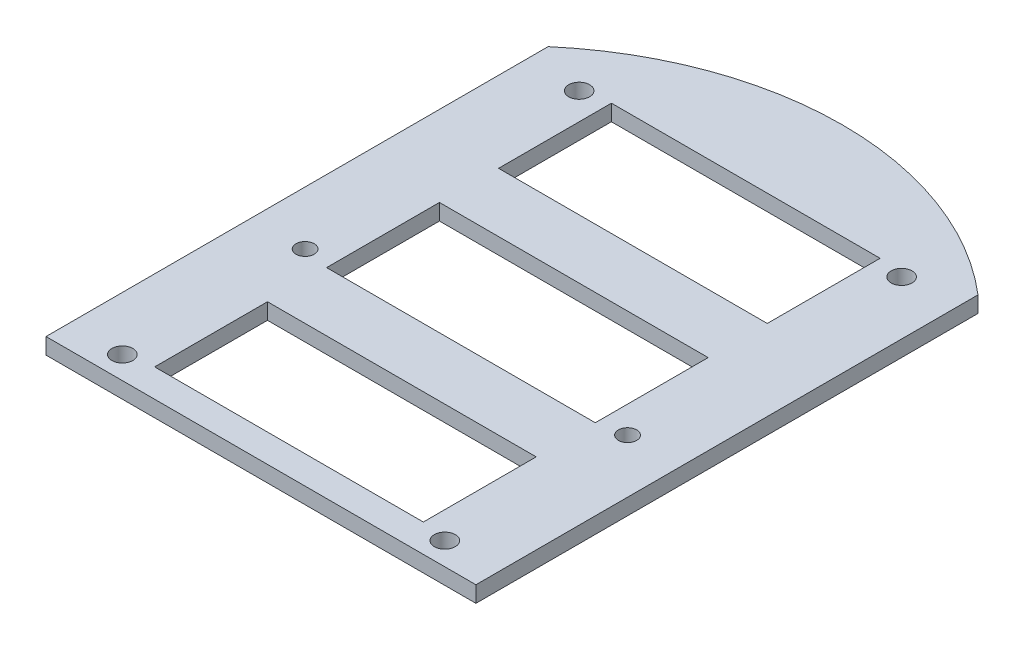
ISO-10303-21;
HEADER;
FILE_DESCRIPTION(('STEP AP214'),'2;1');
FILE_NAME('part.step','',(''),(''),'','','');
FILE_SCHEMA(('AUTOMOTIVE_DESIGN { 1 0 10303 214 1 1 1 1 }'));
ENDSEC;
DATA;
#1=APPLICATION_CONTEXT('core data for automotive mechanical design processes');
#2=APPLICATION_PROTOCOL_DEFINITION('international standard','automotive_design',2000,#1);
#3=PRODUCT_CONTEXT('',#1,'mechanical');
#4=PRODUCT('Part','Part','',(#3));
#5=PRODUCT_RELATED_PRODUCT_CATEGORY('part','',(#4));
#6=PRODUCT_DEFINITION_FORMATION('','',#4);
#7=PRODUCT_DEFINITION_CONTEXT('part definition',#1,'design');
#8=PRODUCT_DEFINITION('design','',#6,#7);
#9=PRODUCT_DEFINITION_SHAPE('','',#8);
#10=(LENGTH_UNIT() NAMED_UNIT(*) SI_UNIT(.MILLI.,.METRE.));
#11=(NAMED_UNIT(*) PLANE_ANGLE_UNIT() SI_UNIT($,.RADIAN.));
#12=(NAMED_UNIT(*) SI_UNIT($,.STERADIAN.) SOLID_ANGLE_UNIT());
#13=UNCERTAINTY_MEASURE_WITH_UNIT(LENGTH_MEASURE(1.E-05),#10,'distance_accuracy_value','');
#14=(GEOMETRIC_REPRESENTATION_CONTEXT(3) GLOBAL_UNCERTAINTY_ASSIGNED_CONTEXT((#13)) GLOBAL_UNIT_ASSIGNED_CONTEXT((#10,
#11,#12)) REPRESENTATION_CONTEXT('',''));
#15=CARTESIAN_POINT('',(0.,0.,0.));
#16=DIRECTION('',(0.,0.,1.));
#17=DIRECTION('',(1.,0.,0.));
#18=AXIS2_PLACEMENT_3D('',#15,#16,#17);
#19=CARTESIAN_POINT('',(0.,3.,0.));
#20=DIRECTION('',(0.,-1.,0.));
#21=DIRECTION('',(0.,0.,-1.));
#22=AXIS2_PLACEMENT_3D('',#19,#20,#21);
#23=CYLINDRICAL_SURFACE('',#22,61.5);
#24=CARTESIAN_POINT('',(0.,3.,0.));
#25=DIRECTION('',(0.,1.,0.));
#26=DIRECTION('',(0.,0.,1.));
#27=AXIS2_PLACEMENT_3D('',#24,#25,#26);
#28=CIRCLE('',#27,61.5);
#29=CARTESIAN_POINT('',(40.,3.,-46.7145587584856));
#30=VERTEX_POINT('',#29);
#31=CARTESIAN_POINT('',(-40.,3.,-46.7145587584856));
#32=VERTEX_POINT('',#31);
#33=EDGE_CURVE('E168',#30,#32,#28,.T.);
#34=ORIENTED_EDGE('',*,*,#33,.F.);
#35=DIRECTION('',(0.,-1.,0.));
#36=VECTOR('',#35,1.);
#37=CARTESIAN_POINT('',(40.,3.,-46.7145587584856));
#38=LINE('',#37,#36);
#39=CARTESIAN_POINT('',(40.,0.,-46.7145587584856));
#40=VERTEX_POINT('',#39);
#41=EDGE_CURVE('E175',#30,#40,#38,.T.);
#42=ORIENTED_EDGE('',*,*,#41,.T.);
#43=CARTESIAN_POINT('',(0.,0.,0.));
#44=DIRECTION('',(0.,1.,0.));
#45=DIRECTION('',(0.,0.,1.));
#46=AXIS2_PLACEMENT_3D('',#43,#44,#45);
#47=CIRCLE('',#46,61.5);
#48=CARTESIAN_POINT('',(-40.,0.,-46.7145587584856));
#49=VERTEX_POINT('',#48);
#50=EDGE_CURVE('E157',#40,#49,#47,.T.);
#51=ORIENTED_EDGE('',*,*,#50,.T.);
#52=DIRECTION('',(0.,-1.,0.));
#53=VECTOR('',#52,1.);
#54=CARTESIAN_POINT('',(-40.,3.,-46.7145587584856));
#55=LINE('',#54,#53);
#56=EDGE_CURVE('E158',#49,#32,#55,.F.);
#57=ORIENTED_EDGE('',*,*,#56,.T.);
#58=EDGE_LOOP('',(#34,#42,#51,#57));
#59=FACE_BOUND('',#58,.T.);
#60=ADVANCED_FACE('F35',(#59),#23,.T.);
#61=CARTESIAN_POINT('',(0.,3.,0.));
#62=DIRECTION('',(0.,1.,0.));
#63=DIRECTION('',(0.,0.,1.));
#64=AXIS2_PLACEMENT_3D('',#61,#62,#63);
#65=PLANE('',#64);
#66=DIRECTION('',(-1.,0.,0.));
#67=VECTOR('',#66,1.);
#68=CARTESIAN_POINT('',(-40.,3.,46.7145587584856));
#69=LINE('',#68,#67);
#70=CARTESIAN_POINT('',(40.,3.,46.7145587584856));
#71=VERTEX_POINT('',#70);
#72=CARTESIAN_POINT('',(-40.,3.,46.7145587584856));
#73=VERTEX_POINT('',#72);
#74=EDGE_CURVE('E152',#71,#73,#69,.T.);
#75=ORIENTED_EDGE('',*,*,#74,.F.);
#76=DIRECTION('',(0.,0.,1.));
#77=VECTOR('',#76,1.);
#78=CARTESIAN_POINT('',(40.,3.,-47.340051558472));
#79=LINE('',#78,#77);
#80=EDGE_CURVE('E180',#30,#71,#79,.T.);
#81=ORIENTED_EDGE('',*,*,#80,.F.);
#82=ORIENTED_EDGE('',*,*,#33,.T.);
#83=DIRECTION('',(0.,0.,-1.));
#84=VECTOR('',#83,1.);
#85=CARTESIAN_POINT('',(-40.,3.,-47.340051558472));
#86=LINE('',#85,#84);
#87=EDGE_CURVE('E173',#73,#32,#86,.T.);
#88=ORIENTED_EDGE('',*,*,#87,.F.);
#89=EDGE_LOOP('',(#75,#81,#82,#88));
#90=FACE_BOUND('',#89,.T.);
#91=DIRECTION('',(0.,0.,1.));
#92=VECTOR('',#91,1.);
#93=CARTESIAN_POINT('',(-25.,3.,9.5));
#94=LINE('',#93,#92);
#95=CARTESIAN_POINT('',(-25.,3.,-11.5));
#96=VERTEX_POINT('',#95);
#97=CARTESIAN_POINT('',(-25.,3.,9.5));
#98=VERTEX_POINT('',#97);
#99=EDGE_CURVE('E49',#96,#98,#94,.T.);
#100=ORIENTED_EDGE('',*,*,#99,.F.);
#101=DIRECTION('',(-1.,0.,0.));
#102=VECTOR('',#101,1.);
#103=CARTESIAN_POINT('',(25.,3.,-11.5));
#104=LINE('',#103,#102);
#105=CARTESIAN_POINT('',(25.,3.,-11.5));
#106=VERTEX_POINT('',#105);
#107=EDGE_CURVE('E292',#106,#96,#104,.T.);
#108=ORIENTED_EDGE('',*,*,#107,.F.);
#109=DIRECTION('',(0.,0.,-1.));
#110=VECTOR('',#109,1.);
#111=CARTESIAN_POINT('',(25.,3.,9.49999999999999));
#112=LINE('',#111,#110);
#113=CARTESIAN_POINT('',(25.,3.,9.49999999999999));
#114=VERTEX_POINT('',#113);
#115=EDGE_CURVE('E296',#114,#106,#112,.T.);
#116=ORIENTED_EDGE('',*,*,#115,.F.);
#117=DIRECTION('',(1.,0.,0.));
#118=VECTOR('',#117,1.);
#119=CARTESIAN_POINT('',(25.,3.,9.49999999999999));
#120=LINE('',#119,#118);
#121=EDGE_CURVE('E299',#98,#114,#120,.T.);
#122=ORIENTED_EDGE('',*,*,#121,.F.);
#123=EDGE_LOOP('',(#100,#108,#116,#122));
#124=FACE_BOUND('',#123,.T.);
#125=DIRECTION('',(0.,0.,1.));
#126=VECTOR('',#125,1.);
#127=CARTESIAN_POINT('',(-24.9999999999999,3.,41.5));
#128=LINE('',#127,#126);
#129=CARTESIAN_POINT('',(-24.9999999999999,3.,20.5));
#130=VERTEX_POINT('',#129);
#131=CARTESIAN_POINT('',(-24.9999999999999,3.,41.5));
#132=VERTEX_POINT('',#131);
#133=EDGE_CURVE('E271',#130,#132,#128,.T.);
#134=ORIENTED_EDGE('',*,*,#133,.F.);
#135=DIRECTION('',(-1.,0.,0.));
#136=VECTOR('',#135,1.);
#137=CARTESIAN_POINT('',(25.0000000000001,3.,20.5));
#138=LINE('',#137,#136);
#139=CARTESIAN_POINT('',(25.0000000000001,3.,20.5));
#140=VERTEX_POINT('',#139);
#141=EDGE_CURVE('E261',#140,#130,#138,.T.);
#142=ORIENTED_EDGE('',*,*,#141,.F.);
#143=DIRECTION('',(0.,0.,-1.));
#144=VECTOR('',#143,1.);
#145=CARTESIAN_POINT('',(25.0000000000001,3.,41.5));
#146=LINE('',#145,#144);
#147=CARTESIAN_POINT('',(25.0000000000001,3.,41.5));
#148=VERTEX_POINT('',#147);
#149=EDGE_CURVE('E265',#148,#140,#146,.T.);
#150=ORIENTED_EDGE('',*,*,#149,.F.);
#151=DIRECTION('',(1.,0.,0.));
#152=VECTOR('',#151,1.);
#153=CARTESIAN_POINT('',(25.0000000000001,3.,41.5));
#154=LINE('',#153,#152);
#155=EDGE_CURVE('E268',#132,#148,#154,.T.);
#156=ORIENTED_EDGE('',*,*,#155,.F.);
#157=EDGE_LOOP('',(#134,#142,#150,#156));
#158=FACE_BOUND('',#157,.T.);
#159=DIRECTION('',(0.,0.,1.));
#160=VECTOR('',#159,1.);
#161=CARTESIAN_POINT('',(-25.,3.,-22.5));
#162=LINE('',#161,#160);
#163=CARTESIAN_POINT('',(-25.,3.,-43.5));
#164=VERTEX_POINT('',#163);
#165=CARTESIAN_POINT('',(-25.,3.,-22.5));
#166=VERTEX_POINT('',#165);
#167=EDGE_CURVE('E239',#164,#166,#162,.T.);
#168=ORIENTED_EDGE('',*,*,#167,.F.);
#169=DIRECTION('',(-1.,0.,0.));
#170=VECTOR('',#169,1.);
#171=CARTESIAN_POINT('',(25.,3.,-43.5));
#172=LINE('',#171,#170);
#173=CARTESIAN_POINT('',(25.,3.,-43.5));
#174=VERTEX_POINT('',#173);
#175=EDGE_CURVE('E229',#174,#164,#172,.T.);
#176=ORIENTED_EDGE('',*,*,#175,.F.);
#177=DIRECTION('',(0.,0.,-1.));
#178=VECTOR('',#177,1.);
#179=CARTESIAN_POINT('',(25.,3.,-22.5));
#180=LINE('',#179,#178);
#181=CARTESIAN_POINT('',(25.,3.,-22.5));
#182=VERTEX_POINT('',#181);
#183=EDGE_CURVE('E233',#182,#174,#180,.T.);
#184=ORIENTED_EDGE('',*,*,#183,.F.);
#185=DIRECTION('',(1.,0.,0.));
#186=VECTOR('',#185,1.);
#187=CARTESIAN_POINT('',(25.,3.,-22.5));
#188=LINE('',#187,#186);
#189=EDGE_CURVE('E236',#166,#182,#188,.T.);
#190=ORIENTED_EDGE('',*,*,#189,.F.);
#191=EDGE_LOOP('',(#168,#176,#184,#190));
#192=FACE_BOUND('',#191,.T.);
#193=CARTESIAN_POINT('',(-30.,3.,-42.5));
#194=DIRECTION('',(0.,1.,0.));
#195=DIRECTION('',(0.,0.,1.));
#196=AXIS2_PLACEMENT_3D('',#193,#194,#195);
#197=CIRCLE('',#196,1.94999999999999);
#198=CARTESIAN_POINT('',(-30.,3.,-40.55));
#199=VERTEX_POINT('',#198);
#200=EDGE_CURVE('E216',#199,#199,#197,.T.);
#201=ORIENTED_EDGE('',*,*,#200,.F.);
#202=EDGE_LOOP('',(#201));
#203=FACE_BOUND('',#202,.T.);
#204=CARTESIAN_POINT('',(30.,3.,-42.5));
#205=DIRECTION('',(0.,1.,0.));
#206=DIRECTION('',(0.,0.,1.));
#207=AXIS2_PLACEMENT_3D('',#204,#205,#206);
#208=CIRCLE('',#207,1.94999999999999);
#209=CARTESIAN_POINT('',(30.,3.,-40.55));
#210=VERTEX_POINT('',#209);
#211=EDGE_CURVE('E210',#210,#210,#208,.T.);
#212=ORIENTED_EDGE('',*,*,#211,.F.);
#213=EDGE_LOOP('',(#212));
#214=FACE_BOUND('',#213,.T.);
#215=CARTESIAN_POINT('',(30.,3.,42.5));
#216=DIRECTION('',(0.,1.,0.));
#217=DIRECTION('',(0.,0.,1.));
#218=AXIS2_PLACEMENT_3D('',#215,#216,#217);
#219=CIRCLE('',#218,1.94999999999999);
#220=CARTESIAN_POINT('',(30.,3.,44.45));
#221=VERTEX_POINT('',#220);
#222=EDGE_CURVE('E204',#221,#221,#219,.T.);
#223=ORIENTED_EDGE('',*,*,#222,.F.);
#224=EDGE_LOOP('',(#223));
#225=FACE_BOUND('',#224,.T.);
#226=CARTESIAN_POINT('',(-30.,3.,42.5));
#227=DIRECTION('',(0.,1.,0.));
#228=DIRECTION('',(0.,0.,1.));
#229=AXIS2_PLACEMENT_3D('',#226,#227,#228);
#230=CIRCLE('',#229,1.94999999999999);
#231=CARTESIAN_POINT('',(-30.,3.,44.45));
#232=VERTEX_POINT('',#231);
#233=EDGE_CURVE('E198',#232,#232,#230,.T.);
#234=ORIENTED_EDGE('',*,*,#233,.F.);
#235=EDGE_LOOP('',(#234));
#236=FACE_BOUND('',#235,.T.);
#237=CARTESIAN_POINT('',(30.,3.,8.50000000000001));
#238=DIRECTION('',(0.,1.,0.));
#239=DIRECTION('',(0.,0.,1.));
#240=AXIS2_PLACEMENT_3D('',#237,#238,#239);
#241=CIRCLE('',#240,1.7);
#242=CARTESIAN_POINT('',(30.,3.,10.2));
#243=VERTEX_POINT('',#242);
#244=EDGE_CURVE('E192',#243,#243,#241,.T.);
#245=ORIENTED_EDGE('',*,*,#244,.F.);
#246=EDGE_LOOP('',(#245));
#247=FACE_BOUND('',#246,.T.);
#248=CARTESIAN_POINT('',(-30.,3.,8.5));
#249=DIRECTION('',(0.,1.,0.));
#250=DIRECTION('',(0.,0.,1.));
#251=AXIS2_PLACEMENT_3D('',#248,#249,#250);
#252=CIRCLE('',#251,1.7);
#253=CARTESIAN_POINT('',(-30.,3.,10.2));
#254=VERTEX_POINT('',#253);
#255=EDGE_CURVE('E186',#254,#254,#252,.T.);
#256=ORIENTED_EDGE('',*,*,#255,.F.);
#257=EDGE_LOOP('',(#256));
#258=FACE_BOUND('',#257,.T.);
#259=ADVANCED_FACE('F324',(#90,#124,#158,#192,#203,#214,#225,#236,#247,#258),#65,.T.);
#260=CARTESIAN_POINT('',(0.,0.,0.));
#261=DIRECTION('',(0.,1.,0.));
#262=DIRECTION('',(0.,0.,1.));
#263=AXIS2_PLACEMENT_3D('',#260,#261,#262);
#264=PLANE('',#263);
#265=DIRECTION('',(-1.,0.,0.));
#266=VECTOR('',#265,1.);
#267=CARTESIAN_POINT('',(25.,0.,-11.5));
#268=LINE('',#267,#266);
#269=CARTESIAN_POINT('',(25.,0.,-11.5));
#270=VERTEX_POINT('',#269);
#271=CARTESIAN_POINT('',(-25.,0.,-11.5));
#272=VERTEX_POINT('',#271);
#273=EDGE_CURVE('E287',#270,#272,#268,.T.);
#274=ORIENTED_EDGE('',*,*,#273,.T.);
#275=DIRECTION('',(0.,0.,1.));
#276=VECTOR('',#275,1.);
#277=CARTESIAN_POINT('',(-25.,0.,9.5));
#278=LINE('',#277,#276);
#279=CARTESIAN_POINT('',(-25.,0.,9.5));
#280=VERTEX_POINT('',#279);
#281=EDGE_CURVE('E295',#272,#280,#278,.T.);
#282=ORIENTED_EDGE('',*,*,#281,.T.);
#283=DIRECTION('',(1.,0.,0.));
#284=VECTOR('',#283,1.);
#285=CARTESIAN_POINT('',(25.,0.,9.49999999999999));
#286=LINE('',#285,#284);
#287=CARTESIAN_POINT('',(25.,0.,9.49999999999999));
#288=VERTEX_POINT('',#287);
#289=EDGE_CURVE('E306',#280,#288,#286,.T.);
#290=ORIENTED_EDGE('',*,*,#289,.T.);
#291=DIRECTION('',(0.,0.,-1.));
#292=VECTOR('',#291,1.);
#293=CARTESIAN_POINT('',(25.,0.,9.49999999999999));
#294=LINE('',#293,#292);
#295=EDGE_CURVE('E57',#288,#270,#294,.T.);
#296=ORIENTED_EDGE('',*,*,#295,.T.);
#297=EDGE_LOOP('',(#274,#282,#290,#296));
#298=FACE_BOUND('',#297,.T.);
#299=DIRECTION('',(-1.,0.,0.));
#300=VECTOR('',#299,1.);
#301=CARTESIAN_POINT('',(25.0000000000001,0.,20.5));
#302=LINE('',#301,#300);
#303=CARTESIAN_POINT('',(25.0000000000001,0.,20.5));
#304=VERTEX_POINT('',#303);
#305=CARTESIAN_POINT('',(-24.9999999999999,0.,20.5));
#306=VERTEX_POINT('',#305);
#307=EDGE_CURVE('E256',#304,#306,#302,.T.);
#308=ORIENTED_EDGE('',*,*,#307,.T.);
#309=DIRECTION('',(0.,0.,1.));
#310=VECTOR('',#309,1.);
#311=CARTESIAN_POINT('',(-24.9999999999999,0.,41.5));
#312=LINE('',#311,#310);
#313=CARTESIAN_POINT('',(-24.9999999999999,0.,41.5));
#314=VERTEX_POINT('',#313);
#315=EDGE_CURVE('E264',#306,#314,#312,.T.);
#316=ORIENTED_EDGE('',*,*,#315,.T.);
#317=DIRECTION('',(1.,0.,0.));
#318=VECTOR('',#317,1.);
#319=CARTESIAN_POINT('',(25.0000000000001,0.,41.5));
#320=LINE('',#319,#318);
#321=CARTESIAN_POINT('',(25.0000000000001,0.,41.5));
#322=VERTEX_POINT('',#321);
#323=EDGE_CURVE('E279',#314,#322,#320,.T.);
#324=ORIENTED_EDGE('',*,*,#323,.T.);
#325=DIRECTION('',(0.,0.,-1.));
#326=VECTOR('',#325,1.);
#327=CARTESIAN_POINT('',(25.0000000000001,0.,41.5));
#328=LINE('',#327,#326);
#329=EDGE_CURVE('E276',#322,#304,#328,.T.);
#330=ORIENTED_EDGE('',*,*,#329,.T.);
#331=EDGE_LOOP('',(#308,#316,#324,#330));
#332=FACE_BOUND('',#331,.T.);
#333=DIRECTION('',(-1.,0.,0.));
#334=VECTOR('',#333,1.);
#335=CARTESIAN_POINT('',(25.,0.,-43.5));
#336=LINE('',#335,#334);
#337=CARTESIAN_POINT('',(25.,0.,-43.5));
#338=VERTEX_POINT('',#337);
#339=CARTESIAN_POINT('',(-25.,0.,-43.5));
#340=VERTEX_POINT('',#339);
#341=EDGE_CURVE('E224',#338,#340,#336,.T.);
#342=ORIENTED_EDGE('',*,*,#341,.T.);
#343=DIRECTION('',(0.,0.,1.));
#344=VECTOR('',#343,1.);
#345=CARTESIAN_POINT('',(-25.,0.,-22.5));
#346=LINE('',#345,#344);
#347=CARTESIAN_POINT('',(-25.,0.,-22.5));
#348=VERTEX_POINT('',#347);
#349=EDGE_CURVE('E232',#340,#348,#346,.T.);
#350=ORIENTED_EDGE('',*,*,#349,.T.);
#351=DIRECTION('',(1.,0.,0.));
#352=VECTOR('',#351,1.);
#353=CARTESIAN_POINT('',(25.,0.,-22.5));
#354=LINE('',#353,#352);
#355=CARTESIAN_POINT('',(25.,0.,-22.5));
#356=VERTEX_POINT('',#355);
#357=EDGE_CURVE('E247',#348,#356,#354,.T.);
#358=ORIENTED_EDGE('',*,*,#357,.T.);
#359=DIRECTION('',(0.,0.,-1.));
#360=VECTOR('',#359,1.);
#361=CARTESIAN_POINT('',(25.,0.,-22.5));
#362=LINE('',#361,#360);
#363=EDGE_CURVE('E244',#356,#338,#362,.T.);
#364=ORIENTED_EDGE('',*,*,#363,.T.);
#365=EDGE_LOOP('',(#342,#350,#358,#364));
#366=FACE_BOUND('',#365,.T.);
#367=CARTESIAN_POINT('',(-30.,0.,-42.5));
#368=DIRECTION('',(0.,1.,0.));
#369=DIRECTION('',(0.,0.,1.));
#370=AXIS2_PLACEMENT_3D('',#367,#368,#369);
#371=CIRCLE('',#370,1.95);
#372=CARTESIAN_POINT('',(-30.,0.,-40.55));
#373=VERTEX_POINT('',#372);
#374=EDGE_CURVE('E213',#373,#373,#371,.T.);
#375=ORIENTED_EDGE('',*,*,#374,.T.);
#376=EDGE_LOOP('',(#375));
#377=FACE_BOUND('',#376,.T.);
#378=CARTESIAN_POINT('',(30.,0.,-42.5));
#379=DIRECTION('',(0.,1.,0.));
#380=DIRECTION('',(0.,0.,1.));
#381=AXIS2_PLACEMENT_3D('',#378,#379,#380);
#382=CIRCLE('',#381,1.95);
#383=CARTESIAN_POINT('',(30.,0.,-40.55));
#384=VERTEX_POINT('',#383);
#385=EDGE_CURVE('E207',#384,#384,#382,.T.);
#386=ORIENTED_EDGE('',*,*,#385,.T.);
#387=EDGE_LOOP('',(#386));
#388=FACE_BOUND('',#387,.T.);
#389=CARTESIAN_POINT('',(30.,0.,42.5));
#390=DIRECTION('',(0.,1.,0.));
#391=DIRECTION('',(0.,0.,1.));
#392=AXIS2_PLACEMENT_3D('',#389,#390,#391);
#393=CIRCLE('',#392,1.95);
#394=CARTESIAN_POINT('',(30.,0.,44.45));
#395=VERTEX_POINT('',#394);
#396=EDGE_CURVE('E201',#395,#395,#393,.T.);
#397=ORIENTED_EDGE('',*,*,#396,.T.);
#398=EDGE_LOOP('',(#397));
#399=FACE_BOUND('',#398,.T.);
#400=CARTESIAN_POINT('',(-30.,0.,42.5));
#401=DIRECTION('',(0.,1.,0.));
#402=DIRECTION('',(0.,0.,1.));
#403=AXIS2_PLACEMENT_3D('',#400,#401,#402);
#404=CIRCLE('',#403,1.95);
#405=CARTESIAN_POINT('',(-30.,0.,44.45));
#406=VERTEX_POINT('',#405);
#407=EDGE_CURVE('E195',#406,#406,#404,.T.);
#408=ORIENTED_EDGE('',*,*,#407,.T.);
#409=EDGE_LOOP('',(#408));
#410=FACE_BOUND('',#409,.T.);
#411=CARTESIAN_POINT('',(30.,0.,8.50000000000001));
#412=DIRECTION('',(0.,1.,0.));
#413=DIRECTION('',(0.,0.,1.));
#414=AXIS2_PLACEMENT_3D('',#411,#412,#413);
#415=CIRCLE('',#414,1.7);
#416=CARTESIAN_POINT('',(30.,0.,10.2));
#417=VERTEX_POINT('',#416);
#418=EDGE_CURVE('E189',#417,#417,#415,.T.);
#419=ORIENTED_EDGE('',*,*,#418,.T.);
#420=EDGE_LOOP('',(#419));
#421=FACE_BOUND('',#420,.T.);
#422=CARTESIAN_POINT('',(-30.,0.,8.5));
#423=DIRECTION('',(0.,1.,0.));
#424=DIRECTION('',(0.,0.,1.));
#425=AXIS2_PLACEMENT_3D('',#422,#423,#424);
#426=CIRCLE('',#425,1.7);
#427=CARTESIAN_POINT('',(-30.,0.,10.2));
#428=VERTEX_POINT('',#427);
#429=EDGE_CURVE('E183',#428,#428,#426,.T.);
#430=ORIENTED_EDGE('',*,*,#429,.T.);
#431=EDGE_LOOP('',(#430));
#432=FACE_BOUND('',#431,.T.);
#433=DIRECTION('',(0.,0.,1.));
#434=VECTOR('',#433,1.);
#435=CARTESIAN_POINT('',(40.,0.,0.));
#436=LINE('',#435,#434);
#437=CARTESIAN_POINT('',(40.,0.,46.7145587584856));
#438=VERTEX_POINT('',#437);
#439=EDGE_CURVE('E11',#40,#438,#436,.T.);
#440=ORIENTED_EDGE('',*,*,#439,.T.);
#441=DIRECTION('',(-1.,0.,0.));
#442=VECTOR('',#441,1.);
#443=CARTESIAN_POINT('',(-40.,0.,46.7145587584856));
#444=LINE('',#443,#442);
#445=CARTESIAN_POINT('',(-40.,0.,46.7145587584856));
#446=VERTEX_POINT('',#445);
#447=EDGE_CURVE('E149',#438,#446,#444,.T.);
#448=ORIENTED_EDGE('',*,*,#447,.T.);
#449=DIRECTION('',(0.,0.,-1.));
#450=VECTOR('',#449,1.);
#451=CARTESIAN_POINT('',(-40.,0.,0.));
#452=LINE('',#451,#450);
#453=EDGE_CURVE('E42',#446,#49,#452,.T.);
#454=ORIENTED_EDGE('',*,*,#453,.T.);
#455=ORIENTED_EDGE('',*,*,#50,.F.);
#456=EDGE_LOOP('',(#440,#448,#454,#455));
#457=FACE_BOUND('',#456,.T.);
#458=ADVANCED_FACE('F162',(#298,#332,#366,#377,#388,#399,#410,#421,#432,#457),#264,.F.);
#459=CARTESIAN_POINT('',(-40.,0.,-47.340051558472));
#460=DIRECTION('',(1.,0.,0.));
#461=DIRECTION('',(0.,0.,-1.));
#462=AXIS2_PLACEMENT_3D('',#459,#460,#461);
#463=PLANE('',#462);
#464=ORIENTED_EDGE('',*,*,#87,.T.);
#465=ORIENTED_EDGE('',*,*,#56,.F.);
#466=ORIENTED_EDGE('',*,*,#453,.F.);
#467=DIRECTION('',(0.,-1.,0.));
#468=VECTOR('',#467,1.);
#469=CARTESIAN_POINT('',(-40.,3.,46.7145587584856));
#470=LINE('',#469,#468);
#471=EDGE_CURVE('E146',#73,#446,#470,.T.);
#472=ORIENTED_EDGE('',*,*,#471,.F.);
#473=EDGE_LOOP('',(#464,#465,#466,#472));
#474=FACE_BOUND('',#473,.T.);
#475=ADVANCED_FACE('F166',(#474),#463,.F.);
#476=CARTESIAN_POINT('',(40.,0.,-47.340051558472));
#477=DIRECTION('',(-1.,0.,0.));
#478=DIRECTION('',(0.,0.,1.));
#479=AXIS2_PLACEMENT_3D('',#476,#477,#478);
#480=PLANE('',#479);
#481=ORIENTED_EDGE('',*,*,#80,.T.);
#482=DIRECTION('',(0.,-1.,0.));
#483=VECTOR('',#482,1.);
#484=CARTESIAN_POINT('',(40.,3.,46.7145587584856));
#485=LINE('',#484,#483);
#486=EDGE_CURVE('E178',#438,#71,#485,.F.);
#487=ORIENTED_EDGE('',*,*,#486,.F.);
#488=ORIENTED_EDGE('',*,*,#439,.F.);
#489=ORIENTED_EDGE('',*,*,#41,.F.);
#490=EDGE_LOOP('',(#481,#487,#488,#489));
#491=FACE_BOUND('',#490,.T.);
#492=ADVANCED_FACE('F348',(#491),#480,.F.);
#493=CARTESIAN_POINT('',(-30.,3.,8.5));
#494=DIRECTION('',(0.,1.,0.));
#495=DIRECTION('',(0.,0.,1.));
#496=AXIS2_PLACEMENT_3D('',#493,#494,#495);
#497=CYLINDRICAL_SURFACE('',#496,1.7);
#498=ORIENTED_EDGE('',*,*,#429,.F.);
#499=EDGE_LOOP('',(#498));
#500=FACE_BOUND('',#499,.T.);
#501=ORIENTED_EDGE('',*,*,#255,.T.);
#502=EDGE_LOOP('',(#501));
#503=FACE_BOUND('',#502,.T.);
#504=ADVANCED_FACE('F350',(#500,#503),#497,.F.);
#505=CARTESIAN_POINT('',(30.,3.,8.50000000000001));
#506=DIRECTION('',(0.,1.,0.));
#507=DIRECTION('',(0.,0.,1.));
#508=AXIS2_PLACEMENT_3D('',#505,#506,#507);
#509=CYLINDRICAL_SURFACE('',#508,1.7);
#510=ORIENTED_EDGE('',*,*,#418,.F.);
#511=EDGE_LOOP('',(#510));
#512=FACE_BOUND('',#511,.T.);
#513=ORIENTED_EDGE('',*,*,#244,.T.);
#514=EDGE_LOOP('',(#513));
#515=FACE_BOUND('',#514,.T.);
#516=ADVANCED_FACE('F356',(#512,#515),#509,.F.);
#517=CARTESIAN_POINT('',(-30.,3.,42.5));
#518=DIRECTION('',(0.,1.,0.));
#519=DIRECTION('',(0.,0.,1.));
#520=AXIS2_PLACEMENT_3D('',#517,#518,#519);
#521=CYLINDRICAL_SURFACE('',#520,1.95);
#522=ORIENTED_EDGE('',*,*,#407,.F.);
#523=EDGE_LOOP('',(#522));
#524=FACE_BOUND('',#523,.T.);
#525=ORIENTED_EDGE('',*,*,#233,.T.);
#526=EDGE_LOOP('',(#525));
#527=FACE_BOUND('',#526,.T.);
#528=ADVANCED_FACE('F503',(#524,#527),#521,.F.);
#529=CARTESIAN_POINT('',(30.,3.,42.5));
#530=DIRECTION('',(0.,1.,0.));
#531=DIRECTION('',(0.,0.,1.));
#532=AXIS2_PLACEMENT_3D('',#529,#530,#531);
#533=CYLINDRICAL_SURFACE('',#532,1.94999999999999);
#534=ORIENTED_EDGE('',*,*,#396,.F.);
#535=EDGE_LOOP('',(#534));
#536=FACE_BOUND('',#535,.T.);
#537=ORIENTED_EDGE('',*,*,#222,.T.);
#538=EDGE_LOOP('',(#537));
#539=FACE_BOUND('',#538,.T.);
#540=ADVANCED_FACE('F499',(#536,#539),#533,.F.);
#541=CARTESIAN_POINT('',(30.,3.,-42.5));
#542=DIRECTION('',(0.,1.,0.));
#543=DIRECTION('',(0.,0.,1.));
#544=AXIS2_PLACEMENT_3D('',#541,#542,#543);
#545=CYLINDRICAL_SURFACE('',#544,1.94999999999999);
#546=ORIENTED_EDGE('',*,*,#385,.F.);
#547=EDGE_LOOP('',(#546));
#548=FACE_BOUND('',#547,.T.);
#549=ORIENTED_EDGE('',*,*,#211,.T.);
#550=EDGE_LOOP('',(#549));
#551=FACE_BOUND('',#550,.T.);
#552=ADVANCED_FACE('F495',(#548,#551),#545,.F.);
#553=CARTESIAN_POINT('',(-30.,3.,-42.5));
#554=DIRECTION('',(0.,1.,0.));
#555=DIRECTION('',(0.,0.,1.));
#556=AXIS2_PLACEMENT_3D('',#553,#554,#555);
#557=CYLINDRICAL_SURFACE('',#556,1.95);
#558=ORIENTED_EDGE('',*,*,#374,.F.);
#559=EDGE_LOOP('',(#558));
#560=FACE_BOUND('',#559,.T.);
#561=ORIENTED_EDGE('',*,*,#200,.T.);
#562=EDGE_LOOP('',(#561));
#563=FACE_BOUND('',#562,.T.);
#564=ADVANCED_FACE('F387',(#560,#563),#557,.F.);
#565=CARTESIAN_POINT('',(-25.,0.,-22.5));
#566=DIRECTION('',(-1.,0.,0.));
#567=DIRECTION('',(0.,0.,1.));
#568=AXIS2_PLACEMENT_3D('',#565,#566,#567);
#569=PLANE('',#568);
#570=ORIENTED_EDGE('',*,*,#167,.T.);
#571=DIRECTION('',(0.,1.,0.));
#572=VECTOR('',#571,1.);
#573=CARTESIAN_POINT('',(-25.,0.,-22.5));
#574=LINE('',#573,#572);
#575=EDGE_CURVE('E220',#348,#166,#574,.T.);
#576=ORIENTED_EDGE('',*,*,#575,.F.);
#577=ORIENTED_EDGE('',*,*,#349,.F.);
#578=DIRECTION('',(0.,1.,0.));
#579=VECTOR('',#578,1.);
#580=CARTESIAN_POINT('',(-25.,0.,-43.5));
#581=LINE('',#580,#579);
#582=EDGE_CURVE('E219',#340,#164,#581,.T.);
#583=ORIENTED_EDGE('',*,*,#582,.T.);
#584=EDGE_LOOP('',(#570,#576,#577,#583));
#585=FACE_BOUND('',#584,.T.);
#586=ADVANCED_FACE('F381',(#585),#569,.F.);
#587=CARTESIAN_POINT('',(25.,0.,-43.5));
#588=DIRECTION('',(0.,0.,-1.));
#589=DIRECTION('',(-1.,0.,0.));
#590=AXIS2_PLACEMENT_3D('',#587,#588,#589);
#591=PLANE('',#590);
#592=ORIENTED_EDGE('',*,*,#175,.T.);
#593=ORIENTED_EDGE('',*,*,#582,.F.);
#594=ORIENTED_EDGE('',*,*,#341,.F.);
#595=DIRECTION('',(0.,1.,0.));
#596=VECTOR('',#595,1.);
#597=CARTESIAN_POINT('',(25.,0.,-43.5));
#598=LINE('',#597,#596);
#599=EDGE_CURVE('E226',#338,#174,#598,.T.);
#600=ORIENTED_EDGE('',*,*,#599,.T.);
#601=EDGE_LOOP('',(#592,#593,#594,#600));
#602=FACE_BOUND('',#601,.T.);
#603=ADVANCED_FACE('F386',(#602),#591,.F.);
#604=CARTESIAN_POINT('',(25.,0.,-22.5));
#605=DIRECTION('',(1.,0.,0.));
#606=DIRECTION('',(0.,0.,-1.));
#607=AXIS2_PLACEMENT_3D('',#604,#605,#606);
#608=PLANE('',#607);
#609=ORIENTED_EDGE('',*,*,#183,.T.);
#610=ORIENTED_EDGE('',*,*,#599,.F.);
#611=ORIENTED_EDGE('',*,*,#363,.F.);
#612=DIRECTION('',(0.,1.,0.));
#613=VECTOR('',#612,1.);
#614=CARTESIAN_POINT('',(25.,0.,-22.5));
#615=LINE('',#614,#613);
#616=EDGE_CURVE('E223',#356,#182,#615,.T.);
#617=ORIENTED_EDGE('',*,*,#616,.T.);
#618=EDGE_LOOP('',(#609,#610,#611,#617));
#619=FACE_BOUND('',#618,.T.);
#620=ADVANCED_FACE('F399',(#619),#608,.F.);
#621=CARTESIAN_POINT('',(25.,0.,-22.5));
#622=DIRECTION('',(0.,0.,1.));
#623=DIRECTION('',(1.,0.,0.));
#624=AXIS2_PLACEMENT_3D('',#621,#622,#623);
#625=PLANE('',#624);
#626=ORIENTED_EDGE('',*,*,#189,.T.);
#627=ORIENTED_EDGE('',*,*,#616,.F.);
#628=ORIENTED_EDGE('',*,*,#357,.F.);
#629=ORIENTED_EDGE('',*,*,#575,.T.);
#630=EDGE_LOOP('',(#626,#627,#628,#629));
#631=FACE_BOUND('',#630,.T.);
#632=ADVANCED_FACE('F409',(#631),#625,.F.);
#633=CARTESIAN_POINT('',(-24.9999999999999,0.,41.5));
#634=DIRECTION('',(-1.,0.,0.));
#635=DIRECTION('',(0.,0.,1.));
#636=AXIS2_PLACEMENT_3D('',#633,#634,#635);
#637=PLANE('',#636);
#638=ORIENTED_EDGE('',*,*,#133,.T.);
#639=DIRECTION('',(0.,1.,0.));
#640=VECTOR('',#639,1.);
#641=CARTESIAN_POINT('',(-24.9999999999999,0.,41.5));
#642=LINE('',#641,#640);
#643=EDGE_CURVE('E252',#314,#132,#642,.T.);
#644=ORIENTED_EDGE('',*,*,#643,.F.);
#645=ORIENTED_EDGE('',*,*,#315,.F.);
#646=DIRECTION('',(0.,1.,0.));
#647=VECTOR('',#646,1.);
#648=CARTESIAN_POINT('',(-24.9999999999999,0.,20.5));
#649=LINE('',#648,#647);
#650=EDGE_CURVE('E241',#306,#130,#649,.T.);
#651=ORIENTED_EDGE('',*,*,#650,.T.);
#652=EDGE_LOOP('',(#638,#644,#645,#651));
#653=FACE_BOUND('',#652,.T.);
#654=ADVANCED_FACE('F419',(#653),#637,.F.);
#655=CARTESIAN_POINT('',(25.0000000000001,0.,20.5));
#656=DIRECTION('',(0.,0.,-1.));
#657=DIRECTION('',(-1.,0.,0.));
#658=AXIS2_PLACEMENT_3D('',#655,#656,#657);
#659=PLANE('',#658);
#660=ORIENTED_EDGE('',*,*,#141,.T.);
#661=ORIENTED_EDGE('',*,*,#650,.F.);
#662=ORIENTED_EDGE('',*,*,#307,.F.);
#663=DIRECTION('',(0.,1.,0.));
#664=VECTOR('',#663,1.);
#665=CARTESIAN_POINT('',(25.0000000000001,0.,20.5));
#666=LINE('',#665,#664);
#667=EDGE_CURVE('E258',#304,#140,#666,.T.);
#668=ORIENTED_EDGE('',*,*,#667,.T.);
#669=EDGE_LOOP('',(#660,#661,#662,#668));
#670=FACE_BOUND('',#669,.T.);
#671=ADVANCED_FACE('F429',(#670),#659,.F.);
#672=CARTESIAN_POINT('',(25.0000000000001,0.,41.5));
#673=DIRECTION('',(1.,0.,0.));
#674=DIRECTION('',(0.,0.,-1.));
#675=AXIS2_PLACEMENT_3D('',#672,#673,#674);
#676=PLANE('',#675);
#677=ORIENTED_EDGE('',*,*,#149,.T.);
#678=ORIENTED_EDGE('',*,*,#667,.F.);
#679=ORIENTED_EDGE('',*,*,#329,.F.);
#680=DIRECTION('',(0.,1.,0.));
#681=VECTOR('',#680,1.);
#682=CARTESIAN_POINT('',(25.0000000000001,0.,41.5));
#683=LINE('',#682,#681);
#684=EDGE_CURVE('E255',#322,#148,#683,.T.);
#685=ORIENTED_EDGE('',*,*,#684,.T.);
#686=EDGE_LOOP('',(#677,#678,#679,#685));
#687=FACE_BOUND('',#686,.T.);
#688=ADVANCED_FACE('F439',(#687),#676,.F.);
#689=CARTESIAN_POINT('',(25.0000000000001,0.,41.5));
#690=DIRECTION('',(0.,0.,1.));
#691=DIRECTION('',(1.,0.,0.));
#692=AXIS2_PLACEMENT_3D('',#689,#690,#691);
#693=PLANE('',#692);
#694=ORIENTED_EDGE('',*,*,#155,.T.);
#695=ORIENTED_EDGE('',*,*,#684,.F.);
#696=ORIENTED_EDGE('',*,*,#323,.F.);
#697=ORIENTED_EDGE('',*,*,#643,.T.);
#698=EDGE_LOOP('',(#694,#695,#696,#697));
#699=FACE_BOUND('',#698,.T.);
#700=ADVANCED_FACE('F335',(#699),#693,.F.);
#701=CARTESIAN_POINT('',(-25.,0.,9.5));
#702=DIRECTION('',(-1.,0.,0.));
#703=DIRECTION('',(0.,0.,1.));
#704=AXIS2_PLACEMENT_3D('',#701,#702,#703);
#705=PLANE('',#704);
#706=ORIENTED_EDGE('',*,*,#99,.T.);
#707=DIRECTION('',(0.,1.,0.));
#708=VECTOR('',#707,1.);
#709=CARTESIAN_POINT('',(-25.,0.,9.5));
#710=LINE('',#709,#708);
#711=EDGE_CURVE('E284',#280,#98,#710,.T.);
#712=ORIENTED_EDGE('',*,*,#711,.F.);
#713=ORIENTED_EDGE('',*,*,#281,.F.);
#714=DIRECTION('',(0.,1.,0.));
#715=VECTOR('',#714,1.);
#716=CARTESIAN_POINT('',(-25.,0.,-11.5));
#717=LINE('',#716,#715);
#718=EDGE_CURVE('E273',#272,#96,#717,.T.);
#719=ORIENTED_EDGE('',*,*,#718,.T.);
#720=EDGE_LOOP('',(#706,#712,#713,#719));
#721=FACE_BOUND('',#720,.T.);
#722=ADVANCED_FACE('F316',(#721),#705,.F.);
#723=CARTESIAN_POINT('',(25.,0.,-11.5));
#724=DIRECTION('',(0.,0.,-1.));
#725=DIRECTION('',(-1.,0.,0.));
#726=AXIS2_PLACEMENT_3D('',#723,#724,#725);
#727=PLANE('',#726);
#728=ORIENTED_EDGE('',*,*,#107,.T.);
#729=ORIENTED_EDGE('',*,*,#718,.F.);
#730=ORIENTED_EDGE('',*,*,#273,.F.);
#731=DIRECTION('',(0.,1.,0.));
#732=VECTOR('',#731,1.);
#733=CARTESIAN_POINT('',(25.,0.,-11.5));
#734=LINE('',#733,#732);
#735=EDGE_CURVE('E289',#270,#106,#734,.T.);
#736=ORIENTED_EDGE('',*,*,#735,.T.);
#737=EDGE_LOOP('',(#728,#729,#730,#736));
#738=FACE_BOUND('',#737,.T.);
#739=ADVANCED_FACE('F327',(#738),#727,.F.);
#740=CARTESIAN_POINT('',(25.,0.,9.49999999999999));
#741=DIRECTION('',(1.,0.,0.));
#742=DIRECTION('',(0.,0.,-1.));
#743=AXIS2_PLACEMENT_3D('',#740,#741,#742);
#744=PLANE('',#743);
#745=ORIENTED_EDGE('',*,*,#115,.T.);
#746=ORIENTED_EDGE('',*,*,#735,.F.);
#747=ORIENTED_EDGE('',*,*,#295,.F.);
#748=DIRECTION('',(0.,1.,0.));
#749=VECTOR('',#748,1.);
#750=CARTESIAN_POINT('',(25.,0.,9.49999999999999));
#751=LINE('',#750,#749);
#752=EDGE_CURVE('E286',#288,#114,#751,.T.);
#753=ORIENTED_EDGE('',*,*,#752,.T.);
#754=EDGE_LOOP('',(#745,#746,#747,#753));
#755=FACE_BOUND('',#754,.T.);
#756=ADVANCED_FACE('F321',(#755),#744,.F.);
#757=CARTESIAN_POINT('',(25.,0.,9.49999999999999));
#758=DIRECTION('',(0.,0.,1.));
#759=DIRECTION('',(1.,0.,0.));
#760=AXIS2_PLACEMENT_3D('',#757,#758,#759);
#761=PLANE('',#760);
#762=ORIENTED_EDGE('',*,*,#121,.T.);
#763=ORIENTED_EDGE('',*,*,#752,.F.);
#764=ORIENTED_EDGE('',*,*,#289,.F.);
#765=ORIENTED_EDGE('',*,*,#711,.T.);
#766=EDGE_LOOP('',(#762,#763,#764,#765));
#767=FACE_BOUND('',#766,.T.);
#768=ADVANCED_FACE('F319',(#767),#761,.F.);
#769=CARTESIAN_POINT('',(-40.,0.,46.7145587584856));
#770=DIRECTION('',(0.,0.,-1.));
#771=DIRECTION('',(-1.,0.,0.));
#772=AXIS2_PLACEMENT_3D('',#769,#770,#771);
#773=PLANE('',#772);
#774=ORIENTED_EDGE('',*,*,#74,.T.);
#775=ORIENTED_EDGE('',*,*,#471,.T.);
#776=ORIENTED_EDGE('',*,*,#447,.F.);
#777=ORIENTED_EDGE('',*,*,#486,.T.);
#778=EDGE_LOOP('',(#774,#775,#776,#777));
#779=FACE_BOUND('',#778,.T.);
#780=ADVANCED_FACE('F148',(#779),#773,.F.);
#781=CLOSED_SHELL('',(#60,#259,#458,#475,#492,#504,#516,#528,#540,#552,#564,#586,#603,#620,#632,
#654,#671,#688,#700,#722,#739,#756,#768,#780));
#782=MANIFOLD_SOLID_BREP('B2',#781);
#783=ADVANCED_BREP_SHAPE_REPRESENTATION('',(#18,#782),#14);
#784=SHAPE_DEFINITION_REPRESENTATION(#9,#783);
ENDSEC;
END-ISO-10303-21;
